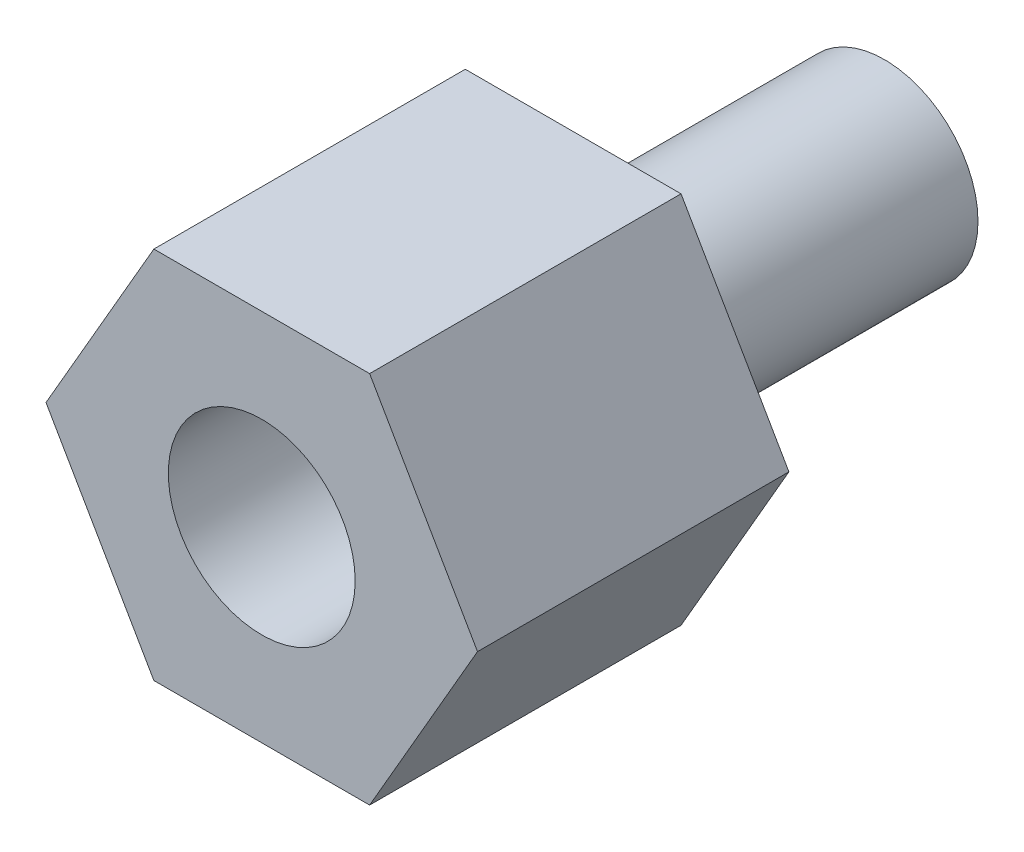
ISO-10303-21;
HEADER;
FILE_DESCRIPTION(('STEP AP214'),'2;1');
FILE_NAME('part.step','',(''),(''),'','','');
FILE_SCHEMA(('AUTOMOTIVE_DESIGN { 1 0 10303 214 1 1 1 1 }'));
ENDSEC;
DATA;
#1=APPLICATION_CONTEXT('core data for automotive mechanical design processes');
#2=APPLICATION_PROTOCOL_DEFINITION('international standard','automotive_design',2000,#1);
#3=PRODUCT_CONTEXT('',#1,'mechanical');
#4=PRODUCT('Part','Part','',(#3));
#5=PRODUCT_RELATED_PRODUCT_CATEGORY('part','',(#4));
#6=PRODUCT_DEFINITION_FORMATION('','',#4);
#7=PRODUCT_DEFINITION_CONTEXT('part definition',#1,'design');
#8=PRODUCT_DEFINITION('design','',#6,#7);
#9=PRODUCT_DEFINITION_SHAPE('','',#8);
#10=(LENGTH_UNIT() NAMED_UNIT(*) SI_UNIT(.MILLI.,.METRE.));
#11=(NAMED_UNIT(*) PLANE_ANGLE_UNIT() SI_UNIT($,.RADIAN.));
#12=(NAMED_UNIT(*) SI_UNIT($,.STERADIAN.) SOLID_ANGLE_UNIT());
#13=UNCERTAINTY_MEASURE_WITH_UNIT(LENGTH_MEASURE(1.E-05),#10,'distance_accuracy_value','');
#14=(GEOMETRIC_REPRESENTATION_CONTEXT(3) GLOBAL_UNCERTAINTY_ASSIGNED_CONTEXT((#13)) GLOBAL_UNIT_ASSIGNED_CONTEXT((#10,
#11,#12)) REPRESENTATION_CONTEXT('',''));
#15=CARTESIAN_POINT('',(0.,0.,0.));
#16=DIRECTION('',(0.,0.,1.));
#17=DIRECTION('',(1.,0.,0.));
#18=AXIS2_PLACEMENT_3D('',#15,#16,#17);
#19=CARTESIAN_POINT('',(0.,0.,5.));
#20=DIRECTION('',(0.,0.,-1.));
#21=DIRECTION('',(-1.,0.,0.));
#22=AXIS2_PLACEMENT_3D('',#19,#20,#21);
#23=CYLINDRICAL_SURFACE('',#22,1.5);
#24=CARTESIAN_POINT('',(0.,0.,5.));
#25=DIRECTION('',(0.,0.,1.));
#26=DIRECTION('',(1.,0.,0.));
#27=AXIS2_PLACEMENT_3D('',#24,#25,#26);
#28=CIRCLE('',#27,1.5);
#29=CARTESIAN_POINT('',(1.5,0.,5.));
#30=VERTEX_POINT('',#29);
#31=EDGE_CURVE('E11',#30,#30,#28,.T.);
#32=ORIENTED_EDGE('',*,*,#31,.F.);
#33=EDGE_LOOP('',(#32));
#34=FACE_BOUND('',#33,.T.);
#35=CARTESIAN_POINT('',(0.,0.,0.));
#36=DIRECTION('',(0.,0.,1.));
#37=DIRECTION('',(1.,0.,0.));
#38=AXIS2_PLACEMENT_3D('',#35,#36,#37);
#39=CIRCLE('',#38,1.5);
#40=CARTESIAN_POINT('',(1.5,0.,0.));
#41=VERTEX_POINT('',#40);
#42=EDGE_CURVE('E37',#41,#41,#39,.T.);
#43=ORIENTED_EDGE('',*,*,#42,.T.);
#44=EDGE_LOOP('',(#43));
#45=FACE_BOUND('',#44,.T.);
#46=ADVANCED_FACE('F34',(#34,#45),#23,.T.);
#47=CARTESIAN_POINT('',(0.,0.,0.));
#48=DIRECTION('',(0.,0.,1.));
#49=DIRECTION('',(1.,0.,0.));
#50=AXIS2_PLACEMENT_3D('',#47,#48,#49);
#51=PLANE('',#50);
#52=ORIENTED_EDGE('',*,*,#42,.F.);
#53=EDGE_LOOP('',(#52));
#54=FACE_BOUND('',#53,.T.);
#55=ADVANCED_FACE('F143',(#54),#51,.F.);
#56=CARTESIAN_POINT('',(-1.73205080756888,3.,10.));
#57=DIRECTION('',(0.866025403784439,-0.5,0.));
#58=DIRECTION('',(0.5,0.866025403784439,0.));
#59=AXIS2_PLACEMENT_3D('',#56,#57,#58);
#60=PLANE('',#59);
#61=DIRECTION('',(-0.5,-0.866025403784439,0.));
#62=VECTOR('',#61,1.);
#63=CARTESIAN_POINT('',(-1.73205080756888,3.,5.));
#64=LINE('',#63,#62);
#65=CARTESIAN_POINT('',(-1.73205080756888,3.,5.));
#66=VERTEX_POINT('',#65);
#67=CARTESIAN_POINT('',(-3.46410161513775,0.,5.));
#68=VERTEX_POINT('',#67);
#69=EDGE_CURVE('E119',#66,#68,#64,.T.);
#70=ORIENTED_EDGE('',*,*,#69,.T.);
#71=DIRECTION('',(0.,0.,-1.));
#72=VECTOR('',#71,1.);
#73=CARTESIAN_POINT('',(-3.46410161513775,0.,10.));
#74=LINE('',#73,#72);
#75=CARTESIAN_POINT('',(-3.46410161513775,0.,10.));
#76=VERTEX_POINT('',#75);
#77=EDGE_CURVE('E137',#76,#68,#74,.T.);
#78=ORIENTED_EDGE('',*,*,#77,.F.);
#79=DIRECTION('',(-0.5,-0.866025403784439,0.));
#80=VECTOR('',#79,1.);
#81=CARTESIAN_POINT('',(-1.73205080756888,3.,10.));
#82=LINE('',#81,#80);
#83=CARTESIAN_POINT('',(-1.73205080756888,3.,10.));
#84=VERTEX_POINT('',#83);
#85=EDGE_CURVE('E130',#84,#76,#82,.T.);
#86=ORIENTED_EDGE('',*,*,#85,.F.);
#87=DIRECTION('',(0.,0.,-1.));
#88=VECTOR('',#87,1.);
#89=CARTESIAN_POINT('',(-1.73205080756888,3.,10.));
#90=LINE('',#89,#88);
#91=EDGE_CURVE('E115',#84,#66,#90,.T.);
#92=ORIENTED_EDGE('',*,*,#91,.T.);
#93=EDGE_LOOP('',(#70,#78,#86,#92));
#94=FACE_BOUND('',#93,.T.);
#95=ADVANCED_FACE('F145',(#94),#60,.F.);
#96=CARTESIAN_POINT('',(-3.46410161513775,0.,10.));
#97=DIRECTION('',(0.866025403784439,0.5,0.));
#98=DIRECTION('',(-0.5,0.866025403784439,0.));
#99=AXIS2_PLACEMENT_3D('',#96,#97,#98);
#100=PLANE('',#99);
#101=DIRECTION('',(0.5,-0.866025403784439,0.));
#102=VECTOR('',#101,1.);
#103=CARTESIAN_POINT('',(-3.46410161513775,0.,5.));
#104=LINE('',#103,#102);
#105=CARTESIAN_POINT('',(-1.73205080756888,-3.,5.));
#106=VERTEX_POINT('',#105);
#107=EDGE_CURVE('E122',#68,#106,#104,.T.);
#108=ORIENTED_EDGE('',*,*,#107,.T.);
#109=DIRECTION('',(0.,0.,-1.));
#110=VECTOR('',#109,1.);
#111=CARTESIAN_POINT('',(-1.73205080756888,-3.,10.));
#112=LINE('',#111,#110);
#113=CARTESIAN_POINT('',(-1.73205080756888,-3.,10.));
#114=VERTEX_POINT('',#113);
#115=EDGE_CURVE('E134',#114,#106,#112,.T.);
#116=ORIENTED_EDGE('',*,*,#115,.F.);
#117=DIRECTION('',(0.5,-0.866025403784439,0.));
#118=VECTOR('',#117,1.);
#119=CARTESIAN_POINT('',(-3.46410161513775,0.,10.));
#120=LINE('',#119,#118);
#121=EDGE_CURVE('E88',#76,#114,#120,.T.);
#122=ORIENTED_EDGE('',*,*,#121,.F.);
#123=ORIENTED_EDGE('',*,*,#77,.T.);
#124=EDGE_LOOP('',(#108,#116,#122,#123));
#125=FACE_BOUND('',#124,.T.);
#126=ADVANCED_FACE('F150',(#125),#100,.F.);
#127=CARTESIAN_POINT('',(-1.73205080756888,-3.,10.));
#128=DIRECTION('',(0.,1.,0.));
#129=DIRECTION('',(-1.,0.,0.));
#130=AXIS2_PLACEMENT_3D('',#127,#128,#129);
#131=PLANE('',#130);
#132=DIRECTION('',(1.,0.,0.));
#133=VECTOR('',#132,1.);
#134=CARTESIAN_POINT('',(-1.73205080756888,-3.,5.));
#135=LINE('',#134,#133);
#136=CARTESIAN_POINT('',(1.73205080756888,-3.,5.));
#137=VERTEX_POINT('',#136);
#138=EDGE_CURVE('E125',#106,#137,#135,.T.);
#139=ORIENTED_EDGE('',*,*,#138,.T.);
#140=DIRECTION('',(0.,0.,-1.));
#141=VECTOR('',#140,1.);
#142=CARTESIAN_POINT('',(1.73205080756888,-3.,10.));
#143=LINE('',#142,#141);
#144=CARTESIAN_POINT('',(1.73205080756888,-3.,10.));
#145=VERTEX_POINT('',#144);
#146=EDGE_CURVE('E110',#145,#137,#143,.T.);
#147=ORIENTED_EDGE('',*,*,#146,.F.);
#148=DIRECTION('',(1.,0.,0.));
#149=VECTOR('',#148,1.);
#150=CARTESIAN_POINT('',(-1.73205080756888,-3.,10.));
#151=LINE('',#150,#149);
#152=EDGE_CURVE('E101',#114,#145,#151,.T.);
#153=ORIENTED_EDGE('',*,*,#152,.F.);
#154=ORIENTED_EDGE('',*,*,#115,.T.);
#155=EDGE_LOOP('',(#139,#147,#153,#154));
#156=FACE_BOUND('',#155,.T.);
#157=ADVANCED_FACE('F157',(#156),#131,.F.);
#158=CARTESIAN_POINT('',(1.73205080756888,-3.,10.));
#159=DIRECTION('',(-0.866025403784439,0.5,0.));
#160=DIRECTION('',(-0.5,-0.866025403784439,0.));
#161=AXIS2_PLACEMENT_3D('',#158,#159,#160);
#162=PLANE('',#161);
#163=DIRECTION('',(0.5,0.866025403784439,0.));
#164=VECTOR('',#163,1.);
#165=CARTESIAN_POINT('',(1.73205080756888,-3.,5.));
#166=LINE('',#165,#164);
#167=CARTESIAN_POINT('',(3.46410161513775,0.,5.));
#168=VERTEX_POINT('',#167);
#169=EDGE_CURVE('E109',#137,#168,#166,.T.);
#170=ORIENTED_EDGE('',*,*,#169,.T.);
#171=DIRECTION('',(0.,0.,-1.));
#172=VECTOR('',#171,1.);
#173=CARTESIAN_POINT('',(3.46410161513775,0.,10.));
#174=LINE('',#173,#172);
#175=CARTESIAN_POINT('',(3.46410161513775,0.,10.));
#176=VERTEX_POINT('',#175);
#177=EDGE_CURVE('E106',#176,#168,#174,.T.);
#178=ORIENTED_EDGE('',*,*,#177,.F.);
#179=DIRECTION('',(0.5,0.866025403784439,0.));
#180=VECTOR('',#179,1.);
#181=CARTESIAN_POINT('',(1.73205080756888,-3.,10.));
#182=LINE('',#181,#180);
#183=EDGE_CURVE('E95',#145,#176,#182,.T.);
#184=ORIENTED_EDGE('',*,*,#183,.F.);
#185=ORIENTED_EDGE('',*,*,#146,.T.);
#186=EDGE_LOOP('',(#170,#178,#184,#185));
#187=FACE_BOUND('',#186,.T.);
#188=ADVANCED_FACE('F107',(#187),#162,.F.);
#189=CARTESIAN_POINT('',(3.46410161513775,0.,10.));
#190=DIRECTION('',(-0.866025403784439,-0.5,0.));
#191=DIRECTION('',(0.5,-0.866025403784439,0.));
#192=AXIS2_PLACEMENT_3D('',#189,#190,#191);
#193=PLANE('',#192);
#194=DIRECTION('',(-0.5,0.866025403784438,0.));
#195=VECTOR('',#194,1.);
#196=CARTESIAN_POINT('',(3.46410161513775,0.,5.));
#197=LINE('',#196,#195);
#198=CARTESIAN_POINT('',(1.73205080756888,3.,5.));
#199=VERTEX_POINT('',#198);
#200=EDGE_CURVE('E73',#168,#199,#197,.T.);
#201=ORIENTED_EDGE('',*,*,#200,.T.);
#202=DIRECTION('',(0.,0.,-1.));
#203=VECTOR('',#202,1.);
#204=CARTESIAN_POINT('',(1.73205080756888,3.,10.));
#205=LINE('',#204,#203);
#206=CARTESIAN_POINT('',(1.73205080756888,3.,10.));
#207=VERTEX_POINT('',#206);
#208=EDGE_CURVE('E111',#207,#199,#205,.T.);
#209=ORIENTED_EDGE('',*,*,#208,.F.);
#210=DIRECTION('',(-0.5,0.866025403784438,0.));
#211=VECTOR('',#210,1.);
#212=CARTESIAN_POINT('',(3.46410161513775,0.,10.));
#213=LINE('',#212,#211);
#214=EDGE_CURVE('E99',#176,#207,#213,.T.);
#215=ORIENTED_EDGE('',*,*,#214,.F.);
#216=ORIENTED_EDGE('',*,*,#177,.T.);
#217=EDGE_LOOP('',(#201,#209,#215,#216));
#218=FACE_BOUND('',#217,.T.);
#219=ADVANCED_FACE('F113',(#218),#193,.F.);
#220=CARTESIAN_POINT('',(1.73205080756888,3.,10.));
#221=DIRECTION('',(0.,-1.,0.));
#222=DIRECTION('',(0.,0.,-1.));
#223=AXIS2_PLACEMENT_3D('',#220,#221,#222);
#224=PLANE('',#223);
#225=DIRECTION('',(-1.,0.,0.));
#226=VECTOR('',#225,1.);
#227=CARTESIAN_POINT('',(1.73205080756888,3.,5.));
#228=LINE('',#227,#226);
#229=EDGE_CURVE('E79',#199,#66,#228,.T.);
#230=ORIENTED_EDGE('',*,*,#229,.T.);
#231=ORIENTED_EDGE('',*,*,#91,.F.);
#232=DIRECTION('',(-1.,0.,0.));
#233=VECTOR('',#232,1.);
#234=CARTESIAN_POINT('',(1.73205080756888,3.,10.));
#235=LINE('',#234,#233);
#236=EDGE_CURVE('E50',#207,#84,#235,.T.);
#237=ORIENTED_EDGE('',*,*,#236,.F.);
#238=ORIENTED_EDGE('',*,*,#208,.T.);
#239=EDGE_LOOP('',(#230,#231,#237,#238));
#240=FACE_BOUND('',#239,.T.);
#241=ADVANCED_FACE('F165',(#240),#224,.F.);
#242=CARTESIAN_POINT('',(0.,0.,10.));
#243=DIRECTION('',(0.,0.,1.));
#244=DIRECTION('',(1.,0.,0.));
#245=AXIS2_PLACEMENT_3D('',#242,#243,#244);
#246=PLANE('',#245);
#247=CARTESIAN_POINT('',(0.,0.,10.));
#248=DIRECTION('',(0.,0.,1.));
#249=DIRECTION('',(1.,0.,0.));
#250=AXIS2_PLACEMENT_3D('',#247,#248,#249);
#251=CIRCLE('',#250,1.5);
#252=CARTESIAN_POINT('',(1.5,0.,10.));
#253=VERTEX_POINT('',#252);
#254=EDGE_CURVE('E186',#253,#253,#251,.T.);
#255=ORIENTED_EDGE('',*,*,#254,.F.);
#256=EDGE_LOOP('',(#255));
#257=FACE_BOUND('',#256,.T.);
#258=ORIENTED_EDGE('',*,*,#85,.T.);
#259=ORIENTED_EDGE('',*,*,#121,.T.);
#260=ORIENTED_EDGE('',*,*,#152,.T.);
#261=ORIENTED_EDGE('',*,*,#183,.T.);
#262=ORIENTED_EDGE('',*,*,#214,.T.);
#263=ORIENTED_EDGE('',*,*,#236,.T.);
#264=EDGE_LOOP('',(#258,#259,#260,#261,#262,#263));
#265=FACE_BOUND('',#264,.T.);
#266=ADVANCED_FACE('F97',(#257,#265),#246,.T.);
#267=CARTESIAN_POINT('',(0.,0.,5.));
#268=DIRECTION('',(0.,0.,1.));
#269=DIRECTION('',(1.,0.,0.));
#270=AXIS2_PLACEMENT_3D('',#267,#268,#269);
#271=PLANE('',#270);
#272=ORIENTED_EDGE('',*,*,#31,.T.);
#273=EDGE_LOOP('',(#272));
#274=FACE_BOUND('',#273,.T.);
#275=ORIENTED_EDGE('',*,*,#69,.F.);
#276=ORIENTED_EDGE('',*,*,#229,.F.);
#277=ORIENTED_EDGE('',*,*,#200,.F.);
#278=ORIENTED_EDGE('',*,*,#169,.F.);
#279=ORIENTED_EDGE('',*,*,#138,.F.);
#280=ORIENTED_EDGE('',*,*,#107,.F.);
#281=EDGE_LOOP('',(#275,#276,#277,#278,#279,#280));
#282=FACE_BOUND('',#281,.T.);
#283=ADVANCED_FACE('F168',(#274,#282),#271,.F.);
#284=CARTESIAN_POINT('',(0.,0.,6.));
#285=DIRECTION('',(0.,0.,1.));
#286=DIRECTION('',(1.,0.,0.));
#287=AXIS2_PLACEMENT_3D('',#284,#285,#286);
#288=CYLINDRICAL_SURFACE('',#287,1.5);
#289=CARTESIAN_POINT('',(0.,0.,6.));
#290=DIRECTION('',(0.,0.,1.));
#291=DIRECTION('',(1.,0.,0.));
#292=AXIS2_PLACEMENT_3D('',#289,#290,#291);
#293=CIRCLE('',#292,1.5);
#294=CARTESIAN_POINT('',(1.5,0.,6.));
#295=VERTEX_POINT('',#294);
#296=EDGE_CURVE('E123',#295,#295,#293,.T.);
#297=ORIENTED_EDGE('',*,*,#296,.F.);
#298=EDGE_LOOP('',(#297));
#299=FACE_BOUND('',#298,.T.);
#300=ORIENTED_EDGE('',*,*,#254,.T.);
#301=EDGE_LOOP('',(#300));
#302=FACE_BOUND('',#301,.T.);
#303=ADVANCED_FACE('F171',(#299,#302),#288,.F.);
#304=CARTESIAN_POINT('',(0.,0.,6.));
#305=DIRECTION('',(0.,0.,1.));
#306=DIRECTION('',(1.,0.,0.));
#307=AXIS2_PLACEMENT_3D('',#304,#305,#306);
#308=PLANE('',#307);
#309=ORIENTED_EDGE('',*,*,#296,.T.);
#310=EDGE_LOOP('',(#309));
#311=FACE_BOUND('',#310,.T.);
#312=ADVANCED_FACE('F178',(#311),#308,.T.);
#313=CLOSED_SHELL('',(#46,#55,#95,#126,#157,#188,#219,#241,#266,#283,#303,#312));
#314=MANIFOLD_SOLID_BREP('B2',#313);
#315=ADVANCED_BREP_SHAPE_REPRESENTATION('',(#18,#314),#14);
#316=SHAPE_DEFINITION_REPRESENTATION(#9,#315);
ENDSEC;
END-ISO-10303-21;
